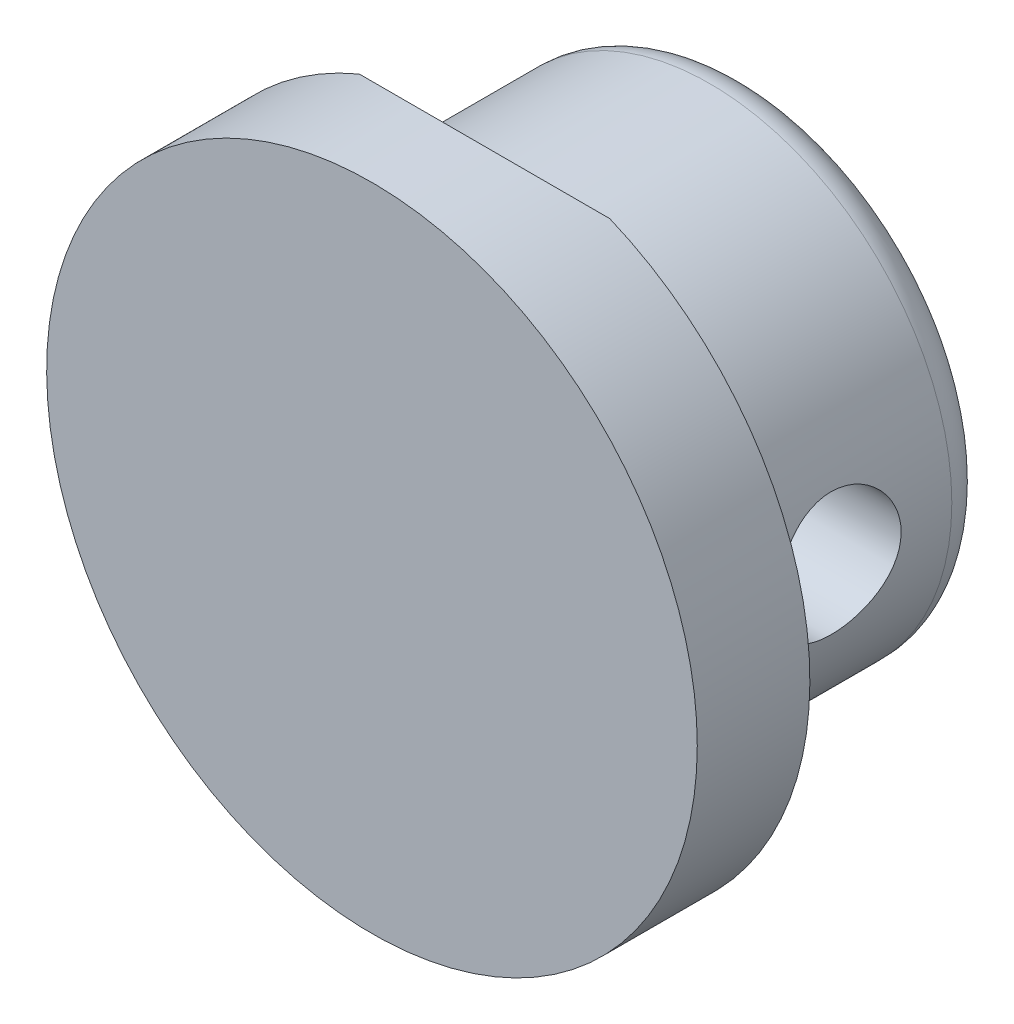
ISO-10303-21;
HEADER;
FILE_DESCRIPTION(('STEP AP214'),'2;1');
FILE_NAME('part.step','',(''),(''),'','','');
FILE_SCHEMA(('AUTOMOTIVE_DESIGN { 1 0 10303 214 1 1 1 1 }'));
ENDSEC;
DATA;
#1=APPLICATION_CONTEXT('core data for automotive mechanical design processes');
#2=APPLICATION_PROTOCOL_DEFINITION('international standard','automotive_design',2000,#1);
#3=PRODUCT_CONTEXT('',#1,'mechanical');
#4=PRODUCT('Part','Part','',(#3));
#5=PRODUCT_RELATED_PRODUCT_CATEGORY('part','',(#4));
#6=PRODUCT_DEFINITION_FORMATION('','',#4);
#7=PRODUCT_DEFINITION_CONTEXT('part definition',#1,'design');
#8=PRODUCT_DEFINITION('design','',#6,#7);
#9=PRODUCT_DEFINITION_SHAPE('','',#8);
#10=(LENGTH_UNIT() NAMED_UNIT(*) SI_UNIT(.MILLI.,.METRE.));
#11=(NAMED_UNIT(*) PLANE_ANGLE_UNIT() SI_UNIT($,.RADIAN.));
#12=(NAMED_UNIT(*) SI_UNIT($,.STERADIAN.) SOLID_ANGLE_UNIT());
#13=UNCERTAINTY_MEASURE_WITH_UNIT(LENGTH_MEASURE(1.E-05),#10,'distance_accuracy_value','');
#14=(GEOMETRIC_REPRESENTATION_CONTEXT(3) GLOBAL_UNCERTAINTY_ASSIGNED_CONTEXT((#13)) GLOBAL_UNIT_ASSIGNED_CONTEXT((#10,
#11,#12)) REPRESENTATION_CONTEXT('',''));
#15=CARTESIAN_POINT('',(0.,0.,0.));
#16=DIRECTION('',(0.,0.,1.));
#17=DIRECTION('',(1.,0.,0.));
#18=AXIS2_PLACEMENT_3D('',#15,#16,#17);
#19=CARTESIAN_POINT('',(0.,0.,7.));
#20=DIRECTION('',(0.,0.,1.));
#21=DIRECTION('',(1.,0.,0.));
#22=AXIS2_PLACEMENT_3D('',#19,#20,#21);
#23=PLANE('',#22);
#24=CARTESIAN_POINT('',(0.,0.,7.));
#25=DIRECTION('',(0.,0.,1.));
#26=DIRECTION('',(1.,0.,0.));
#27=AXIS2_PLACEMENT_3D('',#24,#25,#26);
#28=CIRCLE('',#27,6.45);
#29=CARTESIAN_POINT('',(6.45,0.,7.));
#30=VERTEX_POINT('',#29);
#31=EDGE_CURVE('E83',#30,#30,#28,.T.);
#32=ORIENTED_EDGE('',*,*,#31,.T.);
#33=EDGE_LOOP('',(#32));
#34=FACE_BOUND('',#33,.T.);
#35=CARTESIAN_POINT('',(0.,0.,7.));
#36=DIRECTION('',(0.,0.,1.));
#37=DIRECTION('',(1.,0.,0.));
#38=AXIS2_PLACEMENT_3D('',#35,#36,#37);
#39=CIRCLE('',#38,8.66784173981295);
#40=CARTESIAN_POINT('',(-3.33638733159739,8.,7.));
#41=VERTEX_POINT('',#40);
#42=CARTESIAN_POINT('',(3.33638733159739,8.,7.));
#43=VERTEX_POINT('',#42);
#44=EDGE_CURVE('E50',#41,#43,#39,.T.);
#45=ORIENTED_EDGE('',*,*,#44,.F.);
#46=DIRECTION('',(1.,0.,0.));
#47=VECTOR('',#46,1.);
#48=CARTESIAN_POINT('',(0.,8.,7.));
#49=LINE('',#48,#47);
#50=EDGE_CURVE('E78',#41,#43,#49,.T.);
#51=ORIENTED_EDGE('',*,*,#50,.T.);
#52=EDGE_LOOP('',(#45,#51));
#53=FACE_BOUND('',#52,.T.);
#54=ADVANCED_FACE('F36',(#34,#53),#23,.F.);
#55=CARTESIAN_POINT('',(-14.75,9.,8.));
#56=DIRECTION('',(0.,-0.707106781186547,0.707106781186548));
#57=DIRECTION('',(-1.,0.,0.));
#58=AXIS2_PLACEMENT_3D('',#55,#56,#57);
#59=PLANE('',#58);
#60=ORIENTED_EDGE('',*,*,#50,.F.);
#61=CARTESIAN_POINT('',(0.,0.,-0.999999999999994));
#62=DIRECTION('',(0.,-0.707106781186547,0.707106781186548));
#63=DIRECTION('',(0.,-0.707106781186548,-0.707106781186547));
#64=AXIS2_PLACEMENT_3D('',#61,#62,#63);
#65=ELLIPSE('',#64,12.2581793449471,8.66784173981295);
#66=EDGE_CURVE('E12',#41,#43,#65,.F.);
#67=ORIENTED_EDGE('',*,*,#66,.T.);
#68=EDGE_LOOP('',(#60,#67));
#69=FACE_BOUND('',#68,.T.);
#70=ADVANCED_FACE('F81',(#69),#59,.F.);
#71=CARTESIAN_POINT('',(0.,0.,7.));
#72=DIRECTION('',(0.,0.,-1.));
#73=DIRECTION('',(-1.,0.,0.));
#74=AXIS2_PLACEMENT_3D('',#71,#72,#73);
#75=CYLINDRICAL_SURFACE('',#74,6.45);
#76=CARTESIAN_POINT('',(0.,0.,1.));
#77=DIRECTION('',(0.,0.,1.));
#78=DIRECTION('',(1.,0.,0.));
#79=AXIS2_PLACEMENT_3D('',#76,#77,#78);
#80=CIRCLE('',#79,6.45);
#81=CARTESIAN_POINT('',(6.45,0.,1.));
#82=VERTEX_POINT('',#81);
#83=EDGE_CURVE('E141',#82,#82,#80,.T.);
#84=ORIENTED_EDGE('',*,*,#83,.T.);
#85=EDGE_LOOP('',(#84));
#86=FACE_BOUND('',#85,.T.);
#87=CARTESIAN_POINT('',(0.,0.,5.90525588832577));
#88=DIRECTION('',(0.,-0.500000000000004,0.866025403784436));
#89=DIRECTION('',(0.,-0.866025403784436,-0.500000000000004));
#90=AXIS2_PLACEMENT_3D('',#87,#88,#89);
#91=ELLIPSE('',#90,7.44781847254619,6.45);
#92=CARTESIAN_POINT('',(-6.45000000000001,0.,5.90525588832577));
#93=VERTEX_POINT('',#92);
#94=CARTESIAN_POINT('',(-6.397020790962,-0.825000000000009,5.42894191624432));
#95=VERTEX_POINT('',#94);
#96=EDGE_CURVE('E97',#93,#95,#91,.T.);
#97=ORIENTED_EDGE('',*,*,#96,.T.);
#98=CARTESIAN_POINT('',(-6.39702079096199,-0.825000000000009,5.42894191624432));
#99=CARTESIAN_POINT('',(-6.39180005048605,-0.865491697270673,5.40556295554254));
#100=CARTESIAN_POINT('',(-6.38631968297751,-0.904943622604579,5.38049035928099));
#101=CARTESIAN_POINT('',(-6.37499559378056,-0.981543167330461,5.3271225360441));
#102=CARTESIAN_POINT('',(-6.36915190770474,-1.01869101185816,5.29882762469541));
#103=CARTESIAN_POINT('',(-6.35131918194295,-1.12628576016326,5.20940479749734));
#104=CARTESIAN_POINT('',(-6.33901811742867,-1.19296051722047,5.14369440154739));
#105=CARTESIAN_POINT('',(-6.31497906850644,-1.3142999860609,5.00191618228211));
#106=CARTESIAN_POINT('',(-6.30324127617509,-1.3689606234435,4.92584485934295));
#107=CARTESIAN_POINT('',(-6.28167812073267,-1.46473021521608,4.76536661100328));
#108=CARTESIAN_POINT('',(-6.27185206834417,-1.50584405762214,4.68096270652061));
#109=CARTESIAN_POINT('',(-6.25534517089537,-1.57300787979672,4.50675408704174));
#110=CARTESIAN_POINT('',(-6.24864256561212,-1.59916237711507,4.41699180707845));
#111=CARTESIAN_POINT('',(-6.23911004885471,-1.63596276137162,4.23413440118097));
#112=CARTESIAN_POINT('',(-6.23627982652125,-1.64660989318302,4.14103954338845));
#113=CARTESIAN_POINT('',(-6.23487248690831,-1.65192919675281,3.95718289672218));
#114=CARTESIAN_POINT('',(-6.2361696946684,-1.64707339734152,3.86643540446481));
#115=CARTESIAN_POINT('',(-6.24258527856362,-1.62258627172285,3.68710558447579));
#116=CARTESIAN_POINT('',(-6.24770340086669,-1.60295592702141,3.59852311332055));
#117=CARTESIAN_POINT('',(-6.26112093890124,-1.54971179076772,3.4264453708037));
#118=CARTESIAN_POINT('',(-6.26940362688395,-1.51617144847176,3.34292598123667));
#119=CARTESIAN_POINT('',(-6.28822301118121,-1.4361180396775,3.18262945240193));
#120=CARTESIAN_POINT('',(-6.29876010857871,-1.3896026643377,3.10585351629772));
#121=CARTESIAN_POINT('',(-6.32126648881094,-1.28339760514665,2.95892667472397));
#122=CARTESIAN_POINT('',(-6.33326744955652,-1.22337754130985,2.88901936618076));
#123=CARTESIAN_POINT('',(-6.3571428400791,-1.09254272504019,2.76012689095883));
#124=CARTESIAN_POINT('',(-6.36901725394718,-1.02172663211268,2.70114308261935));
#125=CARTESIAN_POINT('',(-6.3915583620393,-0.869757298686601,2.59473207320177));
#126=CARTESIAN_POINT('',(-6.40219953821722,-0.788441259059508,2.54753143103172));
#127=CARTESIAN_POINT('',(-6.42082181272683,-0.618727330129621,2.46752693427815));
#128=CARTESIAN_POINT('',(-6.42880327721904,-0.530330417725416,2.43472109777532));
#129=CARTESIAN_POINT('',(-6.44107794981373,-0.35066908561459,2.38505204366411));
#130=CARTESIAN_POINT('',(-6.44543614286158,-0.259487037259363,2.36790735593805));
#131=CARTESIAN_POINT('',(-6.45021511739222,-0.0754436664963203,2.34913339595304));
#132=CARTESIAN_POINT('',(-6.45063656821292,0.0174173677545975,2.34750148615953));
#133=CARTESIAN_POINT('',(-6.44753646100893,0.19969456199883,2.35964751392357));
#134=CARTESIAN_POINT('',(-6.44411398925876,0.28913856547329,2.37303819838848));
#135=CARTESIAN_POINT('',(-6.43385531150153,0.464457274322833,2.4141603277667));
#136=CARTESIAN_POINT('',(-6.42701898668844,0.55033185536523,2.44189227177356));
#137=CARTESIAN_POINT('',(-6.41060860504549,0.716679638817046,2.5110300858175));
#138=CARTESIAN_POINT('',(-6.40101902261271,0.797118920836412,2.55251371260714));
#139=CARTESIAN_POINT('',(-6.38012207893922,0.95000218158934,2.64792063276518));
#140=CARTESIAN_POINT('',(-6.36881441762231,1.02244475981114,2.70184610005525));
#141=CARTESIAN_POINT('',(-6.345324948239,1.15944989932999,2.82240308501592));
#142=CARTESIAN_POINT('',(-6.3331274692687,1.22373201207924,2.88935053237228));
#143=CARTESIAN_POINT('',(-6.30949935316924,1.3402467382317,3.03314785076386));
#144=CARTESIAN_POINT('',(-6.29806878081602,1.39247833470749,3.10999855666996));
#145=CARTESIAN_POINT('',(-6.27717848886727,1.48383118559109,3.27233515695443));
#146=CARTESIAN_POINT('',(-6.26773771769862,1.52282837758674,3.35789349028754));
#147=CARTESIAN_POINT('',(-6.25210501326265,1.58579479165628,3.53464906421704));
#148=CARTESIAN_POINT('',(-6.24591236905597,1.60976730250715,3.62584506597007));
#149=CARTESIAN_POINT('',(-6.23766221251642,1.64144258082216,3.80878772085866));
#150=CARTESIAN_POINT('',(-6.23550269555785,1.64954694547325,3.90046023238754));
#151=CARTESIAN_POINT('',(-6.23527295514579,1.65041588303334,4.08387672181408));
#152=CARTESIAN_POINT('',(-6.23720223848188,1.64318230607734,4.1756206897579));
#153=CARTESIAN_POINT('',(-6.24482996246842,1.61394411373348,4.35459711153658));
#154=CARTESIAN_POINT('',(-6.25044979688827,1.59224741081009,4.44188359712755));
#155=CARTESIAN_POINT('',(-6.26473146905411,1.53508977610488,4.61156887919738));
#156=CARTESIAN_POINT('',(-6.27339385074731,1.49962638299203,4.69396679861631));
#157=CARTESIAN_POINT('',(-6.29296940784003,1.41525179461135,4.85312329586623));
#158=CARTESIAN_POINT('',(-6.3039191851597,1.36611696394402,4.9297585372113));
#159=CARTESIAN_POINT('',(-6.32677172850898,1.2560285499764,5.07382647681709));
#160=CARTESIAN_POINT('',(-6.33867413945166,1.19507935845528,5.14126257887293));
#161=CARTESIAN_POINT('',(-6.35861560511959,1.08291217937505,5.24651802187486));
#162=CARTESIAN_POINT('',(-6.3667374580808,1.0343010416435,5.2871365637692));
#163=CARTESIAN_POINT('',(-6.382406915982,0.932757098319861,5.36252044578848));
#164=CARTESIAN_POINT('',(-6.38995530034042,0.879830368774765,5.39729381119117));
#165=CARTESIAN_POINT('',(-6.39702079096199,0.825000000000006,5.42894191624432));
#166=B_SPLINE_CURVE_WITH_KNOTS('',3,(#98,#99,#100,#101,#102,#103,#104,#105,#106,#107,#108,#109,
#110,#111,#112,#113,#114,#115,#116,#117,#118,#119,#120,#121,#122,#123,#124,#125,#126,#127,#128,
#129,#130,#131,#132,#133,#134,#135,#136,#137,#138,#139,#140,#141,#142,#143,#144,#145,#146,#147,
#148,#149,#150,#151,#152,#153,#154,#155,#156,#157,#158,#159,#160,#161,#162,#163,#164,#165),
.UNSPECIFIED.,.F.,.F.,(4,2,2,2,2,2,2,2,2,2,2,2,2,2,2,2,2,2,2,2,2,2,2,2,2,2,2,2,2,2,2,2,2,4),(0.,
0.14105048875432,0.282087173437956,0.56389644257466,0.845801135953838,1.12760399952654,
1.40741313312105,1.68719980344826,1.95854976944726,2.22988171065457,2.49979881433084,
2.76976397906426,3.04723629557949,3.32474309269392,3.60723343155734,3.88968486410382,
4.16695389689768,4.44417578663673,4.71441238528953,4.98465838914273,5.25645929027089,
5.52830771828514,5.80783641758433,6.08738869732654,6.36949351051652,6.65153655173724,
6.9263442452359,7.20111879201802,7.47022278243848,7.73937490783388,8.01321866688537,
8.28696082392,8.47816577811551,8.66910602973085),.UNSPECIFIED.);
#167=CARTESIAN_POINT('',(-6.397020790962,0.825000000000006,5.42894191624432));
#168=VERTEX_POINT('',#167);
#169=EDGE_CURVE('E106',#95,#168,#166,.T.);
#170=ORIENTED_EDGE('',*,*,#169,.T.);
#171=CARTESIAN_POINT('',(0.,0.,5.90525588832577));
#172=DIRECTION('',(0.,0.500000000000005,0.866025403784436));
#173=DIRECTION('',(0.,0.866025403784436,-0.500000000000005));
#174=AXIS2_PLACEMENT_3D('',#171,#172,#173);
#175=ELLIPSE('',#174,7.44781847254619,6.45);
#176=EDGE_CURVE('E88',#168,#93,#175,.T.);
#177=ORIENTED_EDGE('',*,*,#176,.T.);
#178=EDGE_LOOP('',(#97,#170,#177));
#179=FACE_BOUND('',#178,.T.);
#180=CARTESIAN_POINT('',(6.45,0.,5.90525588832577));
#181=VERTEX_POINT('',#180);
#182=CARTESIAN_POINT('',(6.39702079096199,0.825000000000006,5.42894191624432));
#183=VERTEX_POINT('',#182);
#184=EDGE_CURVE('E82',#181,#183,#175,.T.);
#185=ORIENTED_EDGE('',*,*,#184,.T.);
#186=CARTESIAN_POINT('',(6.39702079096199,0.825000000000006,5.42894191624432));
#187=CARTESIAN_POINT('',(6.39180005048605,0.865491697270671,5.40556295554254));
#188=CARTESIAN_POINT('',(6.38631968297751,0.904943622604577,5.38049035928099));
#189=CARTESIAN_POINT('',(6.37499559378056,0.981543167330459,5.3271225360441));
#190=CARTESIAN_POINT('',(6.36915190770474,1.01869101185816,5.29882762469541));
#191=CARTESIAN_POINT('',(6.35131918194295,1.12628576016325,5.20940479749734));
#192=CARTESIAN_POINT('',(6.33901811742867,1.19296051722047,5.14369440154739));
#193=CARTESIAN_POINT('',(6.31497906850645,1.3142999860609,5.00191618228211));
#194=CARTESIAN_POINT('',(6.30324127617509,1.3689606234435,4.92584485934295));
#195=CARTESIAN_POINT('',(6.28167812073268,1.46473021521608,4.76536661100328));
#196=CARTESIAN_POINT('',(6.27185206834417,1.50584405762214,4.68096270652061));
#197=CARTESIAN_POINT('',(6.25534517089537,1.57300787979671,4.50675408704174));
#198=CARTESIAN_POINT('',(6.24864256561212,1.59916237711507,4.41699180707845));
#199=CARTESIAN_POINT('',(6.23911004885471,1.63596276137161,4.23413440118097));
#200=CARTESIAN_POINT('',(6.23627982652125,1.64660989318302,4.14103954338845));
#201=CARTESIAN_POINT('',(6.23487248690831,1.65192919675281,3.95718289672218));
#202=CARTESIAN_POINT('',(6.23616969466841,1.64707339734152,3.86643540446481));
#203=CARTESIAN_POINT('',(6.24258527856362,1.62258627172285,3.68710558447579));
#204=CARTESIAN_POINT('',(6.24770340086669,1.60295592702141,3.59852311332055));
#205=CARTESIAN_POINT('',(6.26112093890124,1.54971179076772,3.4264453708037));
#206=CARTESIAN_POINT('',(6.26940362688394,1.51617144847176,3.34292598123668));
#207=CARTESIAN_POINT('',(6.28822301118121,1.4361180396775,3.18262945240193));
#208=CARTESIAN_POINT('',(6.29876010857871,1.3896026643377,3.10585351629772));
#209=CARTESIAN_POINT('',(6.32126648881094,1.28339760514665,2.95892667472397));
#210=CARTESIAN_POINT('',(6.33326744955652,1.22337754130985,2.88901936618076));
#211=CARTESIAN_POINT('',(6.3571428400791,1.09254272504019,2.76012689095884));
#212=CARTESIAN_POINT('',(6.36901725394718,1.02172663211268,2.70114308261935));
#213=CARTESIAN_POINT('',(6.3915583620393,0.869757298686602,2.59473207320177));
#214=CARTESIAN_POINT('',(6.40219953821722,0.788441259059508,2.54753143103172));
#215=CARTESIAN_POINT('',(6.42082181272683,0.618727330129622,2.46752693427815));
#216=CARTESIAN_POINT('',(6.42880327721904,0.530330417725417,2.43472109777532));
#217=CARTESIAN_POINT('',(6.44107794981373,0.350669085614591,2.38505204366411));
#218=CARTESIAN_POINT('',(6.44543614286158,0.259487037259363,2.36790735593805));
#219=CARTESIAN_POINT('',(6.45021511739222,0.0754436664963209,2.34913339595304));
#220=CARTESIAN_POINT('',(6.45063656821292,-0.0174173677545971,2.34750148615953));
#221=CARTESIAN_POINT('',(6.44753646100893,-0.19969456199883,2.35964751392357));
#222=CARTESIAN_POINT('',(6.44411398925876,-0.28913856547329,2.37303819838848));
#223=CARTESIAN_POINT('',(6.43385531150153,-0.464457274322833,2.4141603277667));
#224=CARTESIAN_POINT('',(6.42701898668844,-0.55033185536523,2.44189227177356));
#225=CARTESIAN_POINT('',(6.41060860504549,-0.716679638817047,2.5110300858175));
#226=CARTESIAN_POINT('',(6.40101902261271,-0.797118920836413,2.55251371260714));
#227=CARTESIAN_POINT('',(6.38012207893922,-0.950002181589342,2.64792063276518));
#228=CARTESIAN_POINT('',(6.36881441762231,-1.02244475981114,2.70184610005525));
#229=CARTESIAN_POINT('',(6.345324948239,-1.15944989932999,2.82240308501592));
#230=CARTESIAN_POINT('',(6.3331274692687,-1.22373201207924,2.88935053237228));
#231=CARTESIAN_POINT('',(6.30949935316924,-1.34024673823171,3.03314785076386));
#232=CARTESIAN_POINT('',(6.29806878081602,-1.39247833470749,3.10999855666996));
#233=CARTESIAN_POINT('',(6.27717848886727,-1.48383118559109,3.27233515695443));
#234=CARTESIAN_POINT('',(6.26773771769862,-1.52282837758674,3.35789349028754));
#235=CARTESIAN_POINT('',(6.25210501326265,-1.58579479165628,3.53464906421704));
#236=CARTESIAN_POINT('',(6.24591236905597,-1.60976730250716,3.62584506597007));
#237=CARTESIAN_POINT('',(6.23766221251642,-1.64144258082216,3.80878772085866));
#238=CARTESIAN_POINT('',(6.23550269555785,-1.64954694547325,3.90046023238754));
#239=CARTESIAN_POINT('',(6.23527295514579,-1.65041588303335,4.08387672181408));
#240=CARTESIAN_POINT('',(6.23720223848187,-1.64318230607734,4.1756206897579));
#241=CARTESIAN_POINT('',(6.24482996246842,-1.61394411373349,4.35459711153657));
#242=CARTESIAN_POINT('',(6.25044979688827,-1.5922474108101,4.44188359712755));
#243=CARTESIAN_POINT('',(6.26473146905411,-1.53508977610489,4.61156887919738));
#244=CARTESIAN_POINT('',(6.27339385074731,-1.49962638299203,4.69396679861631));
#245=CARTESIAN_POINT('',(6.29296940784003,-1.41525179461135,4.85312329586623));
#246=CARTESIAN_POINT('',(6.30391918515969,-1.36611696394402,4.9297585372113));
#247=CARTESIAN_POINT('',(6.32677172850898,-1.2560285499764,5.07382647681709));
#248=CARTESIAN_POINT('',(6.33867413945166,-1.19507935845528,5.14126257887292));
#249=CARTESIAN_POINT('',(6.35861560511959,-1.08291217937505,5.24651802187486));
#250=CARTESIAN_POINT('',(6.3667374580808,-1.0343010416435,5.28713656376919));
#251=CARTESIAN_POINT('',(6.382406915982,-0.932757098319865,5.36252044578848));
#252=CARTESIAN_POINT('',(6.38995530034042,-0.879830368774768,5.39729381119116));
#253=CARTESIAN_POINT('',(6.39702079096199,-0.825000000000009,5.42894191624432));
#254=B_SPLINE_CURVE_WITH_KNOTS('',3,(#186,#187,#188,#189,#190,#191,#192,#193,#194,#195,#196,
#197,#198,#199,#200,#201,#202,#203,#204,#205,#206,#207,#208,#209,#210,#211,#212,#213,#214,#215,
#216,#217,#218,#219,#220,#221,#222,#223,#224,#225,#226,#227,#228,#229,#230,#231,#232,#233,#234,
#235,#236,#237,#238,#239,#240,#241,#242,#243,#244,#245,#246,#247,#248,#249,#250,#251,#252,#253),
.UNSPECIFIED.,.F.,.F.,(4,2,2,2,2,2,2,2,2,2,2,2,2,2,2,2,2,2,2,2,2,2,2,2,2,2,2,2,2,2,2,2,2,4),(0.,
0.141050488754321,0.282087173437957,0.563896442574661,0.845801135953839,1.12760399952654,
1.40741313312106,1.68719980344826,1.95854976944726,2.22988171065457,2.49979881433083,
2.76976397906426,3.04723629557949,3.32474309269391,3.60723343155734,3.88968486410382,
4.16695389689768,4.44417578663672,4.71441238528953,4.98465838914273,5.25645929027089,
5.52830771828514,5.80783641758432,6.08738869732653,6.36949351051651,6.65153655173724,
6.92634424523589,7.20111879201802,7.47022278243848,7.73937490783388,8.01321866688536,
8.28696082392,8.47816577811551,8.66910602973085),.UNSPECIFIED.);
#255=CARTESIAN_POINT('',(6.39702079096199,-0.825000000000009,5.42894191624432));
#256=VERTEX_POINT('',#255);
#257=EDGE_CURVE('E96',#183,#256,#254,.T.);
#258=ORIENTED_EDGE('',*,*,#257,.T.);
#259=EDGE_CURVE('E86',#256,#181,#91,.T.);
#260=ORIENTED_EDGE('',*,*,#259,.T.);
#261=EDGE_LOOP('',(#185,#258,#260));
#262=FACE_BOUND('',#261,.T.);
#263=ORIENTED_EDGE('',*,*,#31,.F.);
#264=EDGE_LOOP('',(#263));
#265=FACE_BOUND('',#264,.T.);
#266=ADVANCED_FACE('F112',(#86,#179,#262,#265),#75,.T.);
#267=CARTESIAN_POINT('',(0.,0.,0.));
#268=DIRECTION('',(0.,0.,1.));
#269=DIRECTION('',(1.,0.,0.));
#270=AXIS2_PLACEMENT_3D('',#267,#268,#269);
#271=PLANE('',#270);
#272=CARTESIAN_POINT('',(0.,0.,0.));
#273=DIRECTION('',(0.,0.,1.));
#274=DIRECTION('',(1.,0.,0.));
#275=AXIS2_PLACEMENT_3D('',#272,#273,#274);
#276=CIRCLE('',#275,5.45);
#277=CARTESIAN_POINT('',(5.45,0.,0.));
#278=VERTEX_POINT('',#277);
#279=EDGE_CURVE('E44',#278,#278,#276,.F.);
#280=ORIENTED_EDGE('',*,*,#279,.T.);
#281=EDGE_LOOP('',(#280));
#282=FACE_BOUND('',#281,.T.);
#283=ADVANCED_FACE('F121',(#282),#271,.F.);
#284=CARTESIAN_POINT('',(-14.75,0.,4.));
#285=DIRECTION('',(1.,0.,0.));
#286=DIRECTION('',(0.,0.,-1.));
#287=AXIS2_PLACEMENT_3D('',#284,#285,#286);
#288=CYLINDRICAL_SURFACE('',#287,1.65);
#289=DIRECTION('',(1.,0.,0.));
#290=VECTOR('',#289,1.);
#291=CARTESIAN_POINT('',(-14.75,0.825000000000006,5.42894191624432));
#292=LINE('',#291,#290);
#293=EDGE_CURVE('E150',#168,#183,#292,.T.);
#294=ORIENTED_EDGE('',*,*,#293,.F.);
#295=ORIENTED_EDGE('',*,*,#169,.F.);
#296=DIRECTION('',(1.,0.,0.));
#297=VECTOR('',#296,1.);
#298=CARTESIAN_POINT('',(-14.75,-0.825000000000009,5.42894191624432));
#299=LINE('',#298,#297);
#300=EDGE_CURVE('E90',#95,#256,#299,.T.);
#301=ORIENTED_EDGE('',*,*,#300,.T.);
#302=ORIENTED_EDGE('',*,*,#257,.F.);
#303=EDGE_LOOP('',(#294,#295,#301,#302));
#304=FACE_BOUND('',#303,.T.);
#305=ADVANCED_FACE('F115',(#304),#288,.F.);
#306=CARTESIAN_POINT('',(-14.75,-0.825000000000009,5.42894191624432));
#307=DIRECTION('',(0.,-0.500000000000004,0.866025403784436));
#308=DIRECTION('',(0.,-0.866025403784436,-0.500000000000004));
#309=AXIS2_PLACEMENT_3D('',#306,#307,#308);
#310=PLANE('',#309);
#311=ORIENTED_EDGE('',*,*,#300,.F.);
#312=ORIENTED_EDGE('',*,*,#96,.F.);
#313=DIRECTION('',(1.,0.,0.));
#314=VECTOR('',#313,1.);
#315=CARTESIAN_POINT('',(-14.75,0.,5.90525588832577));
#316=LINE('',#315,#314);
#317=EDGE_CURVE('E57',#93,#181,#316,.T.);
#318=ORIENTED_EDGE('',*,*,#317,.T.);
#319=ORIENTED_EDGE('',*,*,#259,.F.);
#320=EDGE_LOOP('',(#311,#312,#318,#319));
#321=FACE_BOUND('',#320,.T.);
#322=ADVANCED_FACE('F120',(#321),#310,.F.);
#323=CARTESIAN_POINT('',(-14.75,0.,5.90525588832577));
#324=DIRECTION('',(0.,0.500000000000005,0.866025403784436));
#325=DIRECTION('',(0.,-0.866025403784436,0.500000000000005));
#326=AXIS2_PLACEMENT_3D('',#323,#324,#325);
#327=PLANE('',#326);
#328=ORIENTED_EDGE('',*,*,#293,.T.);
#329=ORIENTED_EDGE('',*,*,#184,.F.);
#330=ORIENTED_EDGE('',*,*,#317,.F.);
#331=ORIENTED_EDGE('',*,*,#176,.F.);
#332=EDGE_LOOP('',(#328,#329,#330,#331));
#333=FACE_BOUND('',#332,.T.);
#334=ADVANCED_FACE('F123',(#333),#327,.F.);
#335=CARTESIAN_POINT('',(0.,0.,1.));
#336=DIRECTION('',(0.,0.,1.));
#337=DIRECTION('',(1.,0.,0.));
#338=AXIS2_PLACEMENT_3D('',#335,#336,#337);
#339=TOROIDAL_SURFACE('',#338,5.45,1.);
#340=ORIENTED_EDGE('',*,*,#279,.F.);
#341=EDGE_LOOP('',(#340));
#342=FACE_BOUND('',#341,.T.);
#343=ORIENTED_EDGE('',*,*,#83,.F.);
#344=EDGE_LOOP('',(#343));
#345=FACE_BOUND('',#344,.T.);
#346=ADVANCED_FACE('F38',(#342,#345),#339,.T.);
#347=CARTESIAN_POINT('',(0.,0.,30.));
#348=DIRECTION('',(0.,0.,-1.));
#349=DIRECTION('',(-1.,0.,0.));
#350=AXIS2_PLACEMENT_3D('',#347,#348,#349);
#351=CYLINDRICAL_SURFACE('',#350,8.66784173981295);
#352=CARTESIAN_POINT('',(0.,0.,10.));
#353=DIRECTION('',(0.,0.,1.));
#354=DIRECTION('',(1.,0.,0.));
#355=AXIS2_PLACEMENT_3D('',#352,#353,#354);
#356=CIRCLE('',#355,8.66784173981295);
#357=CARTESIAN_POINT('',(8.66784173981295,0.,10.));
#358=VERTEX_POINT('',#357);
#359=EDGE_CURVE('E79',#358,#358,#356,.T.);
#360=ORIENTED_EDGE('',*,*,#359,.F.);
#361=EDGE_LOOP('',(#360));
#362=FACE_BOUND('',#361,.T.);
#363=ORIENTED_EDGE('',*,*,#44,.T.);
#364=ORIENTED_EDGE('',*,*,#66,.F.);
#365=EDGE_LOOP('',(#363,#364));
#366=FACE_BOUND('',#365,.T.);
#367=ADVANCED_FACE('F73',(#362,#366),#351,.T.);
#368=CARTESIAN_POINT('',(0.,0.,10.));
#369=DIRECTION('',(0.,0.,1.));
#370=DIRECTION('',(1.,0.,0.));
#371=AXIS2_PLACEMENT_3D('',#368,#369,#370);
#372=PLANE('',#371);
#373=ORIENTED_EDGE('',*,*,#359,.T.);
#374=EDGE_LOOP('',(#373));
#375=FACE_BOUND('',#374,.T.);
#376=ADVANCED_FACE('F125',(#375),#372,.T.);
#377=CLOSED_SHELL('',(#54,#70,#266,#283,#305,#322,#334,#346,#367,#376));
#378=MANIFOLD_SOLID_BREP('B2',#377);
#379=ADVANCED_BREP_SHAPE_REPRESENTATION('',(#18,#378),#14);
#380=SHAPE_DEFINITION_REPRESENTATION(#9,#379);
ENDSEC;
END-ISO-10303-21;
